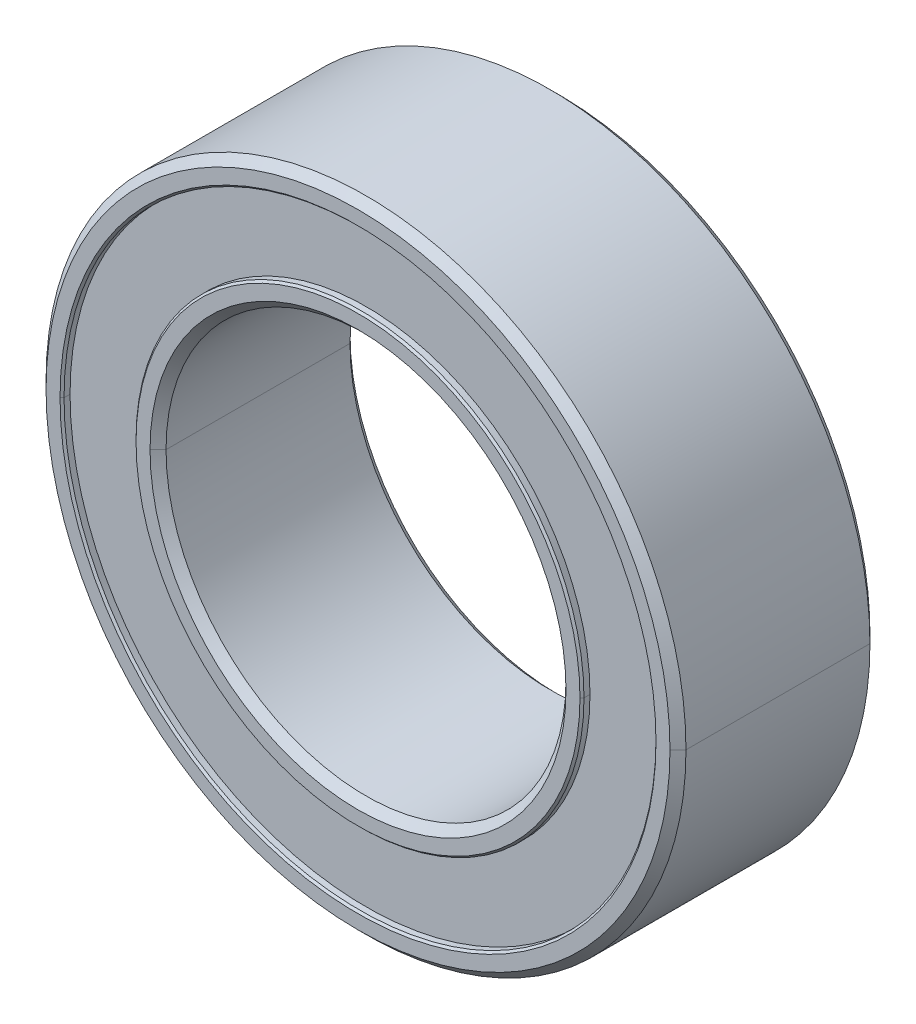
ISO-10303-21;
HEADER;
FILE_DESCRIPTION(('STEP AP214'),'2;1');
FILE_NAME('part.step','',(''),(''),'','','');
FILE_SCHEMA(('AUTOMOTIVE_DESIGN { 1 0 10303 214 1 1 1 1 }'));
ENDSEC;
DATA;
#1=APPLICATION_CONTEXT('core data for automotive mechanical design processes');
#2=APPLICATION_PROTOCOL_DEFINITION('international standard','automotive_design',2000,#1);
#3=PRODUCT_CONTEXT('',#1,'mechanical');
#4=PRODUCT('Part','Part','',(#3));
#5=PRODUCT_RELATED_PRODUCT_CATEGORY('part','',(#4));
#6=PRODUCT_DEFINITION_FORMATION('','',#4);
#7=PRODUCT_DEFINITION_CONTEXT('part definition',#1,'design');
#8=PRODUCT_DEFINITION('design','',#6,#7);
#9=PRODUCT_DEFINITION_SHAPE('','',#8);
#10=(LENGTH_UNIT() NAMED_UNIT(*) SI_UNIT(.MILLI.,.METRE.));
#11=(NAMED_UNIT(*) PLANE_ANGLE_UNIT() SI_UNIT($,.RADIAN.));
#12=(NAMED_UNIT(*) SI_UNIT($,.STERADIAN.) SOLID_ANGLE_UNIT());
#13=UNCERTAINTY_MEASURE_WITH_UNIT(LENGTH_MEASURE(1.E-05),#10,'distance_accuracy_value','');
#14=(GEOMETRIC_REPRESENTATION_CONTEXT(3) GLOBAL_UNCERTAINTY_ASSIGNED_CONTEXT((#13)) GLOBAL_UNIT_ASSIGNED_CONTEXT((#10,
#11,#12)) REPRESENTATION_CONTEXT('',''));
#15=CARTESIAN_POINT('',(0.,0.,0.));
#16=DIRECTION('',(0.,0.,1.));
#17=DIRECTION('',(1.,0.,0.));
#18=AXIS2_PLACEMENT_3D('',#15,#16,#17);
#19=CARTESIAN_POINT('',(0.,0.,1.25));
#20=DIRECTION('',(0.,0.,-1.));
#21=DIRECTION('',(-1.,0.,0.));
#22=AXIS2_PLACEMENT_3D('',#19,#20,#21);
#23=CYLINDRICAL_SURFACE('',#22,4.);
#24=CARTESIAN_POINT('',(0.,0.,1.15));
#25=DIRECTION('',(0.,0.,-1.));
#26=DIRECTION('',(1.,0.,0.));
#27=AXIS2_PLACEMENT_3D('',#24,#25,#26);
#28=CIRCLE('',#27,4.);
#29=CARTESIAN_POINT('',(-4.,0.,1.15));
#30=VERTEX_POINT('',#29);
#31=CARTESIAN_POINT('',(4.,0.,1.15));
#32=VERTEX_POINT('',#31);
#33=EDGE_CURVE('P0_E82',#30,#32,#28,.T.);
#34=ORIENTED_EDGE('',*,*,#33,.T.);
#35=DIRECTION('',(0.,0.,-1.));
#36=VECTOR('',#35,1.);
#37=CARTESIAN_POINT('',(4.,0.,1.25));
#38=LINE('',#37,#36);
#39=CARTESIAN_POINT('',(4.,0.,-1.15));
#40=VERTEX_POINT('',#39);
#41=EDGE_CURVE('P0_E28',#32,#40,#38,.T.);
#42=ORIENTED_EDGE('',*,*,#41,.T.);
#43=CARTESIAN_POINT('',(0.,0.,-1.15));
#44=DIRECTION('',(0.,0.,1.));
#45=DIRECTION('',(1.,0.,0.));
#46=AXIS2_PLACEMENT_3D('',#43,#44,#45);
#47=CIRCLE('',#46,4.);
#48=CARTESIAN_POINT('',(-4.,0.,-1.15));
#49=VERTEX_POINT('',#48);
#50=EDGE_CURVE('P0_E84',#40,#49,#47,.T.);
#51=ORIENTED_EDGE('',*,*,#50,.T.);
#52=DIRECTION('',(0.,0.,-1.));
#53=VECTOR('',#52,1.);
#54=CARTESIAN_POINT('',(-4.,0.,1.25));
#55=LINE('',#54,#53);
#56=EDGE_CURVE('P0_E11',#30,#49,#55,.T.);
#57=ORIENTED_EDGE('',*,*,#56,.F.);
#58=EDGE_LOOP('',(#34,#42,#51,#57));
#59=FACE_BOUND('',#58,.T.);
#60=ADVANCED_FACE('P0_F17',(#59),#23,.T.);
#61=CARTESIAN_POINT('',(0.,0.,1.25));
#62=DIRECTION('',(0.,0.,-1.));
#63=DIRECTION('',(-1.,0.,0.));
#64=AXIS2_PLACEMENT_3D('',#61,#62,#63);
#65=CYLINDRICAL_SURFACE('',#64,4.);
#66=ORIENTED_EDGE('',*,*,#41,.F.);
#67=CARTESIAN_POINT('',(0.,0.,1.15));
#68=DIRECTION('',(0.,0.,-1.));
#69=DIRECTION('',(1.,0.,0.));
#70=AXIS2_PLACEMENT_3D('',#67,#68,#69);
#71=CIRCLE('',#70,4.);
#72=EDGE_CURVE('P0_E100',#32,#30,#71,.T.);
#73=ORIENTED_EDGE('',*,*,#72,.T.);
#74=ORIENTED_EDGE('',*,*,#56,.T.);
#75=CARTESIAN_POINT('',(0.,0.,-1.15));
#76=DIRECTION('',(0.,0.,1.));
#77=DIRECTION('',(1.,0.,0.));
#78=AXIS2_PLACEMENT_3D('',#75,#76,#77);
#79=CIRCLE('',#78,4.);
#80=EDGE_CURVE('P0_E123',#49,#40,#79,.T.);
#81=ORIENTED_EDGE('',*,*,#80,.T.);
#82=EDGE_LOOP('',(#66,#73,#74,#81));
#83=FACE_BOUND('',#82,.T.);
#84=ADVANCED_FACE('P0_F102',(#83),#65,.T.);
#85=CARTESIAN_POINT('',(0.,0.,-1.15));
#86=DIRECTION('',(0.,0.,1.));
#87=DIRECTION('',(1.,0.,0.));
#88=AXIS2_PLACEMENT_3D('',#85,#86,#87);
#89=CONICAL_SURFACE('',#88,4.,0.785398163397);
#90=CARTESIAN_POINT('',(-3.90000000037,0.,-1.25));
#91=CARTESIAN_POINT('',(-3.90000000037,0.386984069698,-1.25));
#92=CARTESIAN_POINT('',(-3.85200106762,0.773967704262,-1.25));
#93=CARTESIAN_POINT('',(-3.7559891833,1.15303288636,-1.25));
#94=CARTESIAN_POINT('',(-3.47197707514,1.8793804213,-1.25));
#95=CARTESIAN_POINT('',(-3.01911954488,2.51433001158,-1.25));
#96=CARTESIAN_POINT('',(-2.75423633879,2.80198532663,-1.25));
#97=CARTESIAN_POINT('',(-2.15870257849,3.30555574085,-1.25));
#98=CARTESIAN_POINT('',(-1.45819006677,3.64837223469,-1.25));
#99=CARTESIAN_POINT('',(-1.0883110124,3.77525081534,-1.25));
#100=CARTESIAN_POINT('',(-0.324866052826,3.93461022536,-1.25));
#101=CARTESIAN_POINT('',(0.454375803529,3.90262486812,-1.25));
#102=CARTESIAN_POINT('',(0.840055924927,3.838130485,-1.25));
#103=CARTESIAN_POINT('',(1.58731054955,3.61485003796,-1.25));
#104=CARTESIAN_POINT('',(2.25737085966,3.21577596133,-1.25));
#105=CARTESIAN_POINT('',(2.56584692078,2.97546116697,-1.25));
#106=CARTESIAN_POINT('',(3.11671390529,2.42338399977,-1.25));
#107=CARTESIAN_POINT('',(3.51601044717,1.75345623454,-1.25));
#108=CARTESIAN_POINT('',(3.67289474559,1.39527193193,-1.25));
#109=CARTESIAN_POINT('',(3.8204957911,0.897313198204,-1.25));
#110=CARTESIAN_POINT('',(3.88410191712,0.385389729641,-1.25));
#111=CARTESIAN_POINT('',(3.89471260262,0.256878859636,-1.25));
#112=CARTESIAN_POINT('',(3.90000000037,0.128439405852,-1.25));
#113=CARTESIAN_POINT('',(3.90000000037,0.,-1.25));
#114=(BOUNDED_CURVE() B_SPLINE_CURVE(5,(#90,#91,#92,#93,#94,#95,#96,#97,#98,#99,#100,#101,#102,
#103,#104,#105,#106,#107,#108,#109,#110,#111,#112,#113),.UNSPECIFIED.,.F.,
.F.) B_SPLINE_CURVE_WITH_KNOTS((6,3,3,3,3,3,3,6),(0.,2.73639059894,5.47278120241,8.209171813,
10.9455624439,13.6819530727,16.4183437087,17.3265474572),
.UNSPECIFIED.) CURVE() GEOMETRIC_REPRESENTATION_ITEM() RATIONAL_B_SPLINE_CURVE((1.,1.,1.,1.,1.,
1.,1.,1.,1.,1.,1.,1.,1.,1.,1.,1.,1.,1.,1.,1.,1.,1.,1.,1.)) REPRESENTATION_ITEM(''));
#115=CARTESIAN_POINT('',(-3.9,0.,-1.25));
#116=VERTEX_POINT('',#115);
#117=CARTESIAN_POINT('',(3.9,0.,-1.25));
#118=VERTEX_POINT('',#117);
#119=EDGE_CURVE('P0_E115',#116,#118,#114,.T.);
#120=ORIENTED_EDGE('',*,*,#119,.F.);
#121=DIRECTION('',(-0.707106781186548,0.,0.707106781186548));
#122=VECTOR('',#121,1.);
#123=CARTESIAN_POINT('',(-3535535.90593,4.32978273047E-10,3535530.75593));
#124=LINE('',#123,#122);
#125=EDGE_CURVE('P0_E99',#116,#49,#124,.T.);
#126=ORIENTED_EDGE('',*,*,#125,.T.);
#127=ORIENTED_EDGE('',*,*,#50,.F.);
#128=DIRECTION('',(0.707106781186548,0.,0.707106781186548));
#129=VECTOR('',#128,1.);
#130=CARTESIAN_POINT('',(3535535.90593,-8.65956546094E-10,3535530.75593));
#131=LINE('',#130,#129);
#132=EDGE_CURVE('P0_E126',#118,#40,#131,.T.);
#133=ORIENTED_EDGE('',*,*,#132,.F.);
#134=EDGE_LOOP('',(#120,#126,#127,#133));
#135=FACE_BOUND('',#134,.T.);
#136=ADVANCED_FACE('P0_F19',(#135),#89,.T.);
#137=CARTESIAN_POINT('',(0.,0.,-1.15));
#138=DIRECTION('',(0.,0.,1.));
#139=DIRECTION('',(1.,0.,0.));
#140=AXIS2_PLACEMENT_3D('',#137,#138,#139);
#141=CONICAL_SURFACE('',#140,4.,0.785398163397);
#142=ORIENTED_EDGE('',*,*,#125,.F.);
#143=CARTESIAN_POINT('',(3.90000000037,0.,-1.25));
#144=CARTESIAN_POINT('',(3.90000000037,-0.386984069697,-1.25));
#145=CARTESIAN_POINT('',(3.85200106762,-0.773967704261,-1.25));
#146=CARTESIAN_POINT('',(3.7559891833,-1.15303288636,-1.25));
#147=CARTESIAN_POINT('',(3.47197707514,-1.8793804213,-1.25));
#148=CARTESIAN_POINT('',(3.01911954488,-2.51433001158,-1.25));
#149=CARTESIAN_POINT('',(2.75423633879,-2.80198532663,-1.25));
#150=CARTESIAN_POINT('',(2.15870257849,-3.30555574085,-1.25));
#151=CARTESIAN_POINT('',(1.45819006677,-3.64837223469,-1.25));
#152=CARTESIAN_POINT('',(1.08831101241,-3.77525081534,-1.25));
#153=CARTESIAN_POINT('',(0.324866052826,-3.93461022536,-1.25));
#154=CARTESIAN_POINT('',(-0.454375803531,-3.90262486812,-1.25));
#155=CARTESIAN_POINT('',(-0.840055924924,-3.838130485,-1.25));
#156=CARTESIAN_POINT('',(-1.58731054955,-3.61485003796,-1.25));
#157=CARTESIAN_POINT('',(-2.25737085965,-3.21577596133,-1.25));
#158=CARTESIAN_POINT('',(-2.56584692078,-2.97546116697,-1.25));
#159=CARTESIAN_POINT('',(-3.11671390529,-2.42338399977,-1.25));
#160=CARTESIAN_POINT('',(-3.51601044717,-1.75345623454,-1.25));
#161=CARTESIAN_POINT('',(-3.67289474559,-1.39527193193,-1.25));
#162=CARTESIAN_POINT('',(-3.8204957911,-0.897313198203,-1.25));
#163=CARTESIAN_POINT('',(-3.88410191712,-0.385389729641,-1.25));
#164=CARTESIAN_POINT('',(-3.89471260262,-0.256878859636,-1.25));
#165=CARTESIAN_POINT('',(-3.90000000037,-0.128439405852,-1.25));
#166=CARTESIAN_POINT('',(-3.90000000037,0.,-1.25));
#167=(BOUNDED_CURVE() B_SPLINE_CURVE(5,(#143,#144,#145,#146,#147,#148,#149,#150,#151,#152,#153,
#154,#155,#156,#157,#158,#159,#160,#161,#162,#163,#164,#165,#166),.UNSPECIFIED.,.F.,
.F.) B_SPLINE_CURVE_WITH_KNOTS((6,3,3,3,3,3,3,6),(0.,2.73639059894,5.47278120241,8.20917181301,
10.9455624439,13.6819530727,16.4183437087,17.3265474572),
.UNSPECIFIED.) CURVE() GEOMETRIC_REPRESENTATION_ITEM() RATIONAL_B_SPLINE_CURVE((1.,1.,1.,1.,1.,
1.,1.,1.,1.,1.,1.,1.,1.,1.,1.,1.,1.,1.,1.,1.,1.,1.,1.,1.)) REPRESENTATION_ITEM(''));
#168=EDGE_CURVE('P0_E134',#118,#116,#167,.T.);
#169=ORIENTED_EDGE('',*,*,#168,.F.);
#170=ORIENTED_EDGE('',*,*,#132,.T.);
#171=ORIENTED_EDGE('',*,*,#80,.F.);
#172=EDGE_LOOP('',(#142,#169,#170,#171));
#173=FACE_BOUND('',#172,.T.);
#174=ADVANCED_FACE('P0_F190',(#173),#141,.T.);
#175=CARTESIAN_POINT('',(0.,0.,1.25));
#176=DIRECTION('',(0.,0.,-1.));
#177=DIRECTION('',(-1.,0.,0.));
#178=AXIS2_PLACEMENT_3D('',#175,#176,#177);
#179=CONICAL_SURFACE('',#178,3.9,0.785398163397);
#180=CARTESIAN_POINT('',(0.,0.,1.25));
#181=DIRECTION('',(0.,0.,1.));
#182=DIRECTION('',(1.,0.,0.));
#183=AXIS2_PLACEMENT_3D('',#180,#181,#182);
#184=CIRCLE('',#183,3.90000000037);
#185=CARTESIAN_POINT('',(3.9,0.,1.25));
#186=VERTEX_POINT('',#185);
#187=CARTESIAN_POINT('',(-3.9,0.,1.25));
#188=VERTEX_POINT('',#187);
#189=EDGE_CURVE('P0_E140',#186,#188,#184,.T.);
#190=ORIENTED_EDGE('',*,*,#189,.F.);
#191=DIRECTION('',(0.707106781186548,0.,-0.707106781186548));
#192=VECTOR('',#191,1.);
#193=CARTESIAN_POINT('',(3535535.85593,4.32978266924E-10,-3535530.70593));
#194=LINE('',#193,#192);
#195=EDGE_CURVE('P0_E97',#186,#32,#194,.T.);
#196=ORIENTED_EDGE('',*,*,#195,.T.);
#197=ORIENTED_EDGE('',*,*,#33,.F.);
#198=DIRECTION('',(-0.707106781186548,0.,-0.707106781186548));
#199=VECTOR('',#198,1.);
#200=CARTESIAN_POINT('',(-3535535.85593,-8.65956533848E-10,-3535530.70593));
#201=LINE('',#200,#199);
#202=EDGE_CURVE('P0_E94',#188,#30,#201,.T.);
#203=ORIENTED_EDGE('',*,*,#202,.F.);
#204=EDGE_LOOP('',(#190,#196,#197,#203));
#205=FACE_BOUND('',#204,.T.);
#206=ADVANCED_FACE('P0_F92',(#205),#179,.T.);
#207=CARTESIAN_POINT('',(0.,0.,1.25));
#208=DIRECTION('',(0.,0.,-1.));
#209=DIRECTION('',(-1.,0.,0.));
#210=AXIS2_PLACEMENT_3D('',#207,#208,#209);
#211=CONICAL_SURFACE('',#210,3.9,0.785398163397);
#212=ORIENTED_EDGE('',*,*,#195,.F.);
#213=CARTESIAN_POINT('',(0.,0.,1.25));
#214=DIRECTION('',(0.,0.,1.));
#215=DIRECTION('',(1.,0.,0.));
#216=AXIS2_PLACEMENT_3D('',#213,#214,#215);
#217=CIRCLE('',#216,3.90000000037);
#218=EDGE_CURVE('P0_E109',#188,#186,#217,.T.);
#219=ORIENTED_EDGE('',*,*,#218,.F.);
#220=ORIENTED_EDGE('',*,*,#202,.T.);
#221=ORIENTED_EDGE('',*,*,#72,.F.);
#222=EDGE_LOOP('',(#212,#219,#220,#221));
#223=FACE_BOUND('',#222,.T.);
#224=ADVANCED_FACE('P0_F107',(#223),#211,.T.);
#225=CARTESIAN_POINT('',(0.,0.,-1.25));
#226=DIRECTION('',(0.,0.,1.));
#227=DIRECTION('',(1.,0.,0.));
#228=AXIS2_PLACEMENT_3D('',#225,#226,#227);
#229=PLANE('',#228);
#230=CARTESIAN_POINT('',(0.,0.,-1.25));
#231=DIRECTION('',(0.,0.,1.));
#232=DIRECTION('',(1.,0.,0.));
#233=AXIS2_PLACEMENT_3D('',#230,#231,#232);
#234=CIRCLE('',#233,3.7);
#235=CARTESIAN_POINT('',(-3.7,0.,-1.25));
#236=VERTEX_POINT('',#235);
#237=CARTESIAN_POINT('',(3.7,0.,-1.25));
#238=VERTEX_POINT('',#237);
#239=EDGE_CURVE('P0_E174',#236,#238,#234,.T.);
#240=ORIENTED_EDGE('',*,*,#239,.T.);
#241=CARTESIAN_POINT('',(0.,0.,-1.25));
#242=DIRECTION('',(0.,0.,1.));
#243=DIRECTION('',(1.,0.,0.));
#244=AXIS2_PLACEMENT_3D('',#241,#242,#243);
#245=CIRCLE('',#244,3.7);
#246=EDGE_CURVE('P0_E142',#238,#236,#245,.T.);
#247=ORIENTED_EDGE('',*,*,#246,.T.);
#248=EDGE_LOOP('',(#240,#247));
#249=FACE_BOUND('',#248,.T.);
#250=ORIENTED_EDGE('',*,*,#168,.T.);
#251=ORIENTED_EDGE('',*,*,#119,.T.);
#252=EDGE_LOOP('',(#250,#251));
#253=FACE_BOUND('',#252,.T.);
#254=ADVANCED_FACE('P0_F194',(#249,#253),#229,.F.);
#255=CARTESIAN_POINT('',(0.,0.,1.25));
#256=DIRECTION('',(0.,0.,-1.));
#257=DIRECTION('',(-1.,0.,0.));
#258=AXIS2_PLACEMENT_3D('',#255,#256,#257);
#259=CYLINDRICAL_SURFACE('',#258,3.7);
#260=DIRECTION('',(0.,0.,-1.));
#261=VECTOR('',#260,1.);
#262=CARTESIAN_POINT('',(3.7,0.,1.25));
#263=LINE('',#262,#261);
#264=CARTESIAN_POINT('',(3.7,0.,1.225));
#265=VERTEX_POINT('',#264);
#266=EDGE_CURVE('P0_E177',#265,#238,#263,.T.);
#267=ORIENTED_EDGE('',*,*,#266,.F.);
#268=CARTESIAN_POINT('',(0.,0.,1.225));
#269=DIRECTION('',(0.,0.,1.));
#270=DIRECTION('',(1.,0.,0.));
#271=AXIS2_PLACEMENT_3D('',#268,#269,#270);
#272=CIRCLE('',#271,3.7);
#273=CARTESIAN_POINT('',(-3.7,0.,1.225));
#274=VERTEX_POINT('',#273);
#275=EDGE_CURVE('P0_E153',#265,#274,#272,.T.);
#276=ORIENTED_EDGE('',*,*,#275,.T.);
#277=DIRECTION('',(0.,0.,-1.));
#278=VECTOR('',#277,1.);
#279=CARTESIAN_POINT('',(-3.7,0.,1.25));
#280=LINE('',#279,#278);
#281=EDGE_CURVE('P0_E157',#274,#236,#280,.T.);
#282=ORIENTED_EDGE('',*,*,#281,.T.);
#283=ORIENTED_EDGE('',*,*,#246,.F.);
#284=EDGE_LOOP('',(#267,#276,#282,#283));
#285=FACE_BOUND('',#284,.T.);
#286=ADVANCED_FACE('P0_F204',(#285),#259,.F.);
#287=CARTESIAN_POINT('',(0.,0.,1.25));
#288=DIRECTION('',(0.,0.,1.));
#289=DIRECTION('',(1.,0.,0.));
#290=AXIS2_PLACEMENT_3D('',#287,#288,#289);
#291=PLANE('',#290);
#292=CARTESIAN_POINT('',(0.,0.,1.25));
#293=DIRECTION('',(0.,0.,-1.));
#294=DIRECTION('',(1.,0.,0.));
#295=AXIS2_PLACEMENT_3D('',#292,#293,#294);
#296=CIRCLE('',#295,3.725);
#297=CARTESIAN_POINT('',(3.725,0.,1.25));
#298=VERTEX_POINT('',#297);
#299=CARTESIAN_POINT('',(-3.725,0.,1.25));
#300=VERTEX_POINT('',#299);
#301=EDGE_CURVE('P0_E121',#298,#300,#296,.T.);
#302=ORIENTED_EDGE('',*,*,#301,.T.);
#303=CARTESIAN_POINT('',(0.,0.,1.25));
#304=DIRECTION('',(0.,0.,-1.));
#305=DIRECTION('',(1.,0.,0.));
#306=AXIS2_PLACEMENT_3D('',#303,#304,#305);
#307=CIRCLE('',#306,3.725);
#308=EDGE_CURVE('P0_E141',#300,#298,#307,.T.);
#309=ORIENTED_EDGE('',*,*,#308,.T.);
#310=EDGE_LOOP('',(#302,#309));
#311=FACE_BOUND('',#310,.T.);
#312=ORIENTED_EDGE('',*,*,#218,.T.);
#313=ORIENTED_EDGE('',*,*,#189,.T.);
#314=EDGE_LOOP('',(#312,#313));
#315=FACE_BOUND('',#314,.T.);
#316=ADVANCED_FACE('P0_F227',(#311,#315),#291,.T.);
#317=CARTESIAN_POINT('',(0.,0.,1.225));
#318=DIRECTION('',(0.,0.,1.));
#319=DIRECTION('',(1.,0.,0.));
#320=AXIS2_PLACEMENT_3D('',#317,#318,#319);
#321=CONICAL_SURFACE('',#320,3.7,0.785398163397);
#322=DIRECTION('',(-0.707106781186548,0.,0.707106781186548));
#323=VECTOR('',#322,1.);
#324=CARTESIAN_POINT('',(-3535535.75593,4.32978254677E-10,3535533.28093));
#325=LINE('',#324,#323);
#326=EDGE_CURVE('P0_E118',#274,#300,#325,.T.);
#327=ORIENTED_EDGE('',*,*,#326,.F.);
#328=ORIENTED_EDGE('',*,*,#275,.F.);
#329=DIRECTION('',(0.707106781186548,0.,0.707106781186548));
#330=VECTOR('',#329,1.);
#331=CARTESIAN_POINT('',(3535535.75593,-8.65956509355E-10,3535533.28093));
#332=LINE('',#331,#330);
#333=EDGE_CURVE('P0_E21',#265,#298,#332,.T.);
#334=ORIENTED_EDGE('',*,*,#333,.T.);
#335=ORIENTED_EDGE('',*,*,#308,.F.);
#336=EDGE_LOOP('',(#327,#328,#334,#335));
#337=FACE_BOUND('',#336,.T.);
#338=ADVANCED_FACE('P0_F214',(#337),#321,.F.);
#339=CARTESIAN_POINT('',(0.,0.,1.25));
#340=DIRECTION('',(0.,0.,-1.));
#341=DIRECTION('',(-1.,0.,0.));
#342=AXIS2_PLACEMENT_3D('',#339,#340,#341);
#343=CYLINDRICAL_SURFACE('',#342,3.7);
#344=CARTESIAN_POINT('',(0.,0.,1.225));
#345=DIRECTION('',(0.,0.,1.));
#346=DIRECTION('',(1.,0.,0.));
#347=AXIS2_PLACEMENT_3D('',#344,#345,#346);
#348=CIRCLE('',#347,3.7);
#349=EDGE_CURVE('P0_E122',#274,#265,#348,.T.);
#350=ORIENTED_EDGE('',*,*,#349,.T.);
#351=ORIENTED_EDGE('',*,*,#266,.T.);
#352=ORIENTED_EDGE('',*,*,#239,.F.);
#353=ORIENTED_EDGE('',*,*,#281,.F.);
#354=EDGE_LOOP('',(#350,#351,#352,#353));
#355=FACE_BOUND('',#354,.T.);
#356=ADVANCED_FACE('P0_F211',(#355),#343,.F.);
#357=CARTESIAN_POINT('',(0.,0.,1.225));
#358=DIRECTION('',(0.,0.,1.));
#359=DIRECTION('',(1.,0.,0.));
#360=AXIS2_PLACEMENT_3D('',#357,#358,#359);
#361=CONICAL_SURFACE('',#360,3.7,0.785398163397);
#362=ORIENTED_EDGE('',*,*,#349,.F.);
#363=ORIENTED_EDGE('',*,*,#326,.T.);
#364=ORIENTED_EDGE('',*,*,#301,.F.);
#365=ORIENTED_EDGE('',*,*,#333,.F.);
#366=EDGE_LOOP('',(#362,#363,#364,#365));
#367=FACE_BOUND('',#366,.T.);
#368=ADVANCED_FACE('P0_F217',(#367),#361,.F.);
#369=CLOSED_SHELL('',(#60,#84,#136,#174,#206,#224,#254,#286,#316,#338,#356,#368));
#370=MANIFOLD_SOLID_BREP('P0_B1',#369);
#371=CARTESIAN_POINT('',(0.,0.,-1.225));
#372=DIRECTION('',(0.,0.,1.));
#373=DIRECTION('',(1.,0.,0.));
#374=AXIS2_PLACEMENT_3D('',#371,#372,#373);
#375=CONICAL_SURFACE('',#374,2.8,0.785398163397);
#376=CARTESIAN_POINT('',(-2.77500000037,0.,-1.25));
#377=CARTESIAN_POINT('',(-2.77500000037,0.326428406667,-1.25));
#378=CARTESIAN_POINT('',(-2.7270020253,0.652856201807,-1.25));
#379=CARTESIAN_POINT('',(-2.63097901262,0.969903242157,-1.25));
#380=CARTESIAN_POINT('',(-2.3486111357,1.56631519937,-1.25));
#381=CARTESIAN_POINT('',(-1.90651570836,2.0562001654,-1.25));
#382=CARTESIAN_POINT('',(-1.65071808528,2.26669200926,-1.25));
#383=CARTESIAN_POINT('',(-1.08488655826,2.60621156579,-1.25));
#384=CARTESIAN_POINT('',(-0.445274188632,2.76848192372,-1.25));
#385=CARTESIAN_POINT('',(-0.115672224209,2.8016749986,-1.25));
#386=CARTESIAN_POINT('',(0.543454313596,2.77019403233,-1.25));
#387=CARTESIAN_POINT('',(1.16561820026,2.55031281878,-1.25));
#388=CARTESIAN_POINT('',(1.45824958018,2.3950513626,-1.25));
#389=CARTESIAN_POINT('',(1.98914724597,2.00315022065,-1.25));
#390=CARTESIAN_POINT('',(2.38476143708,1.4750166633,-1.25));
#391=CARTESIAN_POINT('',(2.5420726101,1.18348202708,-1.25));
#392=CARTESIAN_POINT('',(2.69242685318,0.767362234326,-1.25));
#393=CARTESIAN_POINT('',(2.75819942412,0.334033351842,-1.25));
#394=CARTESIAN_POINT('',(2.76941855339,0.222628122368,-1.25));
#395=CARTESIAN_POINT('',(2.77500000037,0.111314025628,-1.25));
#396=CARTESIAN_POINT('',(2.77500000037,0.,-1.25));
#397=(BOUNDED_CURVE() B_SPLINE_CURVE(5,(#376,#377,#378,#379,#380,#381,#382,#383,#384,#385,#386,
#387,#388,#389,#390,#391,#392,#393,#394,#395,#396),.UNSPECIFIED.,.F.,
.F.) B_SPLINE_CURVE_WITH_KNOTS((6,3,3,3,3,3,6),(0.,2.30819739926,4.61639481179,6.92459224022,
9.23278964065,11.5409870307,12.3280960543),
.UNSPECIFIED.) CURVE() GEOMETRIC_REPRESENTATION_ITEM() RATIONAL_B_SPLINE_CURVE((1.,1.,1.,1.,1.,
1.,1.,1.,1.,1.,1.,1.,1.,1.,1.,1.,1.,1.,1.,1.,1.)) REPRESENTATION_ITEM(''));
#398=CARTESIAN_POINT('',(-2.775,0.,-1.25));
#399=VERTEX_POINT('',#398);
#400=CARTESIAN_POINT('',(2.775,0.,-1.25));
#401=VERTEX_POINT('',#400);
#402=EDGE_CURVE('P1_E90',#399,#401,#397,.T.);
#403=ORIENTED_EDGE('',*,*,#402,.F.);
#404=DIRECTION('',(-0.707106781186548,0.,0.707106781186548));
#405=VECTOR('',#404,1.);
#406=CARTESIAN_POINT('',(-3535535.30593,4.32978199568E-10,3535531.28093));
#407=LINE('',#406,#405);
#408=CARTESIAN_POINT('',(-2.8,0.,-1.225));
#409=VERTEX_POINT('',#408);
#410=EDGE_CURVE('P1_E28',#399,#409,#407,.T.);
#411=ORIENTED_EDGE('',*,*,#410,.T.);
#412=CARTESIAN_POINT('',(0.,0.,-1.22499999963));
#413=DIRECTION('',(0.,0.,1.));
#414=DIRECTION('',(1.,0.,0.));
#415=AXIS2_PLACEMENT_3D('',#412,#413,#414);
#416=CIRCLE('',#415,2.8);
#417=CARTESIAN_POINT('',(2.8,0.,-1.225));
#418=VERTEX_POINT('',#417);
#419=EDGE_CURVE('P1_E92',#418,#409,#416,.T.);
#420=ORIENTED_EDGE('',*,*,#419,.F.);
#421=DIRECTION('',(0.707106781186548,0.,0.707106781186548));
#422=VECTOR('',#421,1.);
#423=CARTESIAN_POINT('',(3535535.30593,-8.65956399137E-10,3535531.28093));
#424=LINE('',#423,#422);
#425=EDGE_CURVE('P1_E11',#401,#418,#424,.T.);
#426=ORIENTED_EDGE('',*,*,#425,.F.);
#427=EDGE_LOOP('',(#403,#411,#420,#426));
#428=FACE_BOUND('',#427,.T.);
#429=ADVANCED_FACE('P1_F17',(#428),#375,.T.);
#430=CARTESIAN_POINT('',(0.,0.,-1.225));
#431=DIRECTION('',(0.,0.,1.));
#432=DIRECTION('',(1.,0.,0.));
#433=AXIS2_PLACEMENT_3D('',#430,#431,#432);
#434=CONICAL_SURFACE('',#433,2.8,0.785398163397);
#435=ORIENTED_EDGE('',*,*,#410,.F.);
#436=CARTESIAN_POINT('',(2.77500000037,0.,-1.25));
#437=CARTESIAN_POINT('',(2.77500000037,-0.326428406665,-1.25));
#438=CARTESIAN_POINT('',(2.7270020253,-0.652856201803,-1.25));
#439=CARTESIAN_POINT('',(2.63097901262,-0.969903242161,-1.25));
#440=CARTESIAN_POINT('',(2.3486111357,-1.56631519937,-1.25));
#441=CARTESIAN_POINT('',(1.90651570837,-2.0562001654,-1.25));
#442=CARTESIAN_POINT('',(1.65071808528,-2.26669200926,-1.25));
#443=CARTESIAN_POINT('',(1.08488655826,-2.60621156579,-1.25));
#444=CARTESIAN_POINT('',(0.445274188631,-2.76848192372,-1.25));
#445=CARTESIAN_POINT('',(0.11567222421,-2.8016749986,-1.25));
#446=CARTESIAN_POINT('',(-0.543454313596,-2.77019403233,-1.25));
#447=CARTESIAN_POINT('',(-1.16561820026,-2.55031281878,-1.25));
#448=CARTESIAN_POINT('',(-1.45824958018,-2.3950513626,-1.25));
#449=CARTESIAN_POINT('',(-1.98914724597,-2.00315022065,-1.25));
#450=CARTESIAN_POINT('',(-2.38476143708,-1.4750166633,-1.25));
#451=CARTESIAN_POINT('',(-2.5420726101,-1.18348202709,-1.25));
#452=CARTESIAN_POINT('',(-2.69242685318,-0.767362234326,-1.25));
#453=CARTESIAN_POINT('',(-2.75819942412,-0.334033351842,-1.25));
#454=CARTESIAN_POINT('',(-2.76941855339,-0.222628122368,-1.25));
#455=CARTESIAN_POINT('',(-2.77500000037,-0.111314025628,-1.25));
#456=CARTESIAN_POINT('',(-2.77500000037,0.,-1.25));
#457=(BOUNDED_CURVE() B_SPLINE_CURVE(5,(#436,#437,#438,#439,#440,#441,#442,#443,#444,#445,#446,
#447,#448,#449,#450,#451,#452,#453,#454,#455,#456),.UNSPECIFIED.,.F.,
.F.) B_SPLINE_CURVE_WITH_KNOTS((6,3,3,3,3,3,6),(0.,2.30819739924,4.61639481177,6.92459224021,
9.23278964064,11.5409870306,12.3280960543),
.UNSPECIFIED.) CURVE() GEOMETRIC_REPRESENTATION_ITEM() RATIONAL_B_SPLINE_CURVE((1.,1.,1.,1.,1.,
1.,1.,1.,1.,1.,1.,1.,1.,1.,1.,1.,1.,1.,1.,1.,1.)) REPRESENTATION_ITEM(''));
#458=EDGE_CURVE('P1_E96',#401,#399,#457,.T.);
#459=ORIENTED_EDGE('',*,*,#458,.F.);
#460=ORIENTED_EDGE('',*,*,#425,.T.);
#461=CARTESIAN_POINT('',(0.,0.,-1.22499999963));
#462=DIRECTION('',(0.,0.,1.));
#463=DIRECTION('',(1.,0.,0.));
#464=AXIS2_PLACEMENT_3D('',#461,#462,#463);
#465=CIRCLE('',#464,2.8);
#466=EDGE_CURVE('P1_E115',#409,#418,#465,.T.);
#467=ORIENTED_EDGE('',*,*,#466,.F.);
#468=EDGE_LOOP('',(#435,#459,#460,#467));
#469=FACE_BOUND('',#468,.T.);
#470=ADVANCED_FACE('P1_F100',(#469),#434,.T.);
#471=CARTESIAN_POINT('',(0.,0.,1.25));
#472=DIRECTION('',(0.,0.,-1.));
#473=DIRECTION('',(-1.,0.,0.));
#474=AXIS2_PLACEMENT_3D('',#471,#472,#473);
#475=CYLINDRICAL_SURFACE('',#474,2.8);
#476=CARTESIAN_POINT('',(0.,0.,1.225));
#477=DIRECTION('',(0.,0.,-1.));
#478=DIRECTION('',(1.,0.,0.));
#479=AXIS2_PLACEMENT_3D('',#476,#477,#478);
#480=CIRCLE('',#479,2.8);
#481=CARTESIAN_POINT('',(-2.8,0.,1.225));
#482=VERTEX_POINT('',#481);
#483=CARTESIAN_POINT('',(2.8,0.,1.225));
#484=VERTEX_POINT('',#483);
#485=EDGE_CURVE('P1_E109',#482,#484,#480,.T.);
#486=ORIENTED_EDGE('',*,*,#485,.T.);
#487=DIRECTION('',(0.,0.,-1.));
#488=VECTOR('',#487,1.);
#489=CARTESIAN_POINT('',(2.8,0.,1.25));
#490=LINE('',#489,#488);
#491=EDGE_CURVE('P1_E98',#484,#418,#490,.T.);
#492=ORIENTED_EDGE('',*,*,#491,.T.);
#493=ORIENTED_EDGE('',*,*,#419,.T.);
#494=DIRECTION('',(0.,0.,-1.));
#495=VECTOR('',#494,1.);
#496=CARTESIAN_POINT('',(-2.8,0.,1.25));
#497=LINE('',#496,#495);
#498=EDGE_CURVE('P1_E158',#482,#409,#497,.T.);
#499=ORIENTED_EDGE('',*,*,#498,.F.);
#500=EDGE_LOOP('',(#486,#492,#493,#499));
#501=FACE_BOUND('',#500,.T.);
#502=ADVANCED_FACE('P1_F222',(#501),#475,.T.);
#503=CARTESIAN_POINT('',(0.,0.,1.25));
#504=DIRECTION('',(0.,0.,-1.));
#505=DIRECTION('',(-1.,0.,0.));
#506=AXIS2_PLACEMENT_3D('',#503,#504,#505);
#507=CYLINDRICAL_SURFACE('',#506,2.8);
#508=ORIENTED_EDGE('',*,*,#491,.F.);
#509=CARTESIAN_POINT('',(0.,0.,1.225));
#510=DIRECTION('',(0.,0.,-1.));
#511=DIRECTION('',(1.,0.,0.));
#512=AXIS2_PLACEMENT_3D('',#509,#510,#511);
#513=CIRCLE('',#512,2.8);
#514=EDGE_CURVE('P1_E145',#484,#482,#513,.T.);
#515=ORIENTED_EDGE('',*,*,#514,.T.);
#516=ORIENTED_EDGE('',*,*,#498,.T.);
#517=ORIENTED_EDGE('',*,*,#466,.T.);
#518=EDGE_LOOP('',(#508,#515,#516,#517));
#519=FACE_BOUND('',#518,.T.);
#520=ADVANCED_FACE('P1_F214',(#519),#507,.T.);
#521=CARTESIAN_POINT('',(0.,0.,-1.25));
#522=DIRECTION('',(0.,0.,1.));
#523=DIRECTION('',(1.,0.,0.));
#524=AXIS2_PLACEMENT_3D('',#521,#522,#523);
#525=PLANE('',#524);
#526=CARTESIAN_POINT('',(0.,0.,-1.25));
#527=DIRECTION('',(0.,0.,1.));
#528=DIRECTION('',(1.,0.,0.));
#529=AXIS2_PLACEMENT_3D('',#526,#527,#528);
#530=CIRCLE('',#529,2.6);
#531=CARTESIAN_POINT('',(-2.6,0.,-1.25));
#532=VERTEX_POINT('',#531);
#533=CARTESIAN_POINT('',(2.6,0.,-1.25));
#534=VERTEX_POINT('',#533);
#535=EDGE_CURVE('P1_E131',#532,#534,#530,.T.);
#536=ORIENTED_EDGE('',*,*,#535,.T.);
#537=CARTESIAN_POINT('',(0.,0.,-1.25));
#538=DIRECTION('',(0.,0.,1.));
#539=DIRECTION('',(1.,0.,0.));
#540=AXIS2_PLACEMENT_3D('',#537,#538,#539);
#541=CIRCLE('',#540,2.6);
#542=EDGE_CURVE('P1_E102',#534,#532,#541,.T.);
#543=ORIENTED_EDGE('',*,*,#542,.T.);
#544=EDGE_LOOP('',(#536,#543));
#545=FACE_BOUND('',#544,.T.);
#546=ORIENTED_EDGE('',*,*,#458,.T.);
#547=ORIENTED_EDGE('',*,*,#402,.T.);
#548=EDGE_LOOP('',(#546,#547));
#549=FACE_BOUND('',#548,.T.);
#550=ADVANCED_FACE('P1_F95',(#545,#549),#525,.F.);
#551=CARTESIAN_POINT('',(0.,0.,-1.25));
#552=DIRECTION('',(0.,0.,-1.));
#553=DIRECTION('',(-1.,0.,0.));
#554=AXIS2_PLACEMENT_3D('',#551,#552,#553);
#555=CONICAL_SURFACE('',#554,2.6,0.785398163397);
#556=DIRECTION('',(0.707106781186548,0.,-0.707106781186548));
#557=VECTOR('',#556,1.);
#558=CARTESIAN_POINT('',(3535535.20593,4.32978187322E-10,-3535533.85593));
#559=LINE('',#558,#557);
#560=CARTESIAN_POINT('',(2.5,0.,-1.15));
#561=VERTEX_POINT('',#560);
#562=EDGE_CURVE('P1_E136',#561,#534,#559,.T.);
#563=ORIENTED_EDGE('',*,*,#562,.F.);
#564=CARTESIAN_POINT('',(0.,0.,-1.15000000037));
#565=DIRECTION('',(0.,0.,-1.));
#566=DIRECTION('',(1.,0.,0.));
#567=AXIS2_PLACEMENT_3D('',#564,#565,#566);
#568=CIRCLE('',#567,2.5);
#569=CARTESIAN_POINT('',(-2.5,0.,-1.15));
#570=VERTEX_POINT('',#569);
#571=EDGE_CURVE('P1_E125',#570,#561,#568,.T.);
#572=ORIENTED_EDGE('',*,*,#571,.F.);
#573=DIRECTION('',(-0.707106781186548,0.,-0.707106781186548));
#574=VECTOR('',#573,1.);
#575=CARTESIAN_POINT('',(-3535535.20593,-8.65956374644E-10,-3535533.85593));
#576=LINE('',#575,#574);
#577=EDGE_CURVE('P1_E135',#570,#532,#576,.T.);
#578=ORIENTED_EDGE('',*,*,#577,.T.);
#579=ORIENTED_EDGE('',*,*,#542,.F.);
#580=EDGE_LOOP('',(#563,#572,#578,#579));
#581=FACE_BOUND('',#580,.T.);
#582=ADVANCED_FACE('P1_F213',(#581),#555,.F.);
#583=CARTESIAN_POINT('',(0.,0.,1.25));
#584=DIRECTION('',(0.,0.,-1.));
#585=DIRECTION('',(-1.,0.,0.));
#586=AXIS2_PLACEMENT_3D('',#583,#584,#585);
#587=CONICAL_SURFACE('',#586,2.775,0.785398163397);
#588=CARTESIAN_POINT('',(0.,0.,1.25));
#589=DIRECTION('',(0.,0.,1.));
#590=DIRECTION('',(1.,0.,0.));
#591=AXIS2_PLACEMENT_3D('',#588,#589,#590);
#592=CIRCLE('',#591,2.77500000037);
#593=CARTESIAN_POINT('',(2.775,0.,1.25));
#594=VERTEX_POINT('',#593);
#595=CARTESIAN_POINT('',(-2.775,0.,1.25));
#596=VERTEX_POINT('',#595);
#597=EDGE_CURVE('P1_E121',#594,#596,#592,.T.);
#598=ORIENTED_EDGE('',*,*,#597,.F.);
#599=DIRECTION('',(0.707106781186548,0.,-0.707106781186548));
#600=VECTOR('',#599,1.);
#601=CARTESIAN_POINT('',(3535535.29343,4.32978198038E-10,-3535531.26843));
#602=LINE('',#601,#600);
#603=EDGE_CURVE('P1_E137',#594,#484,#602,.T.);
#604=ORIENTED_EDGE('',*,*,#603,.T.);
#605=ORIENTED_EDGE('',*,*,#485,.F.);
#606=DIRECTION('',(-0.707106781186548,0.,-0.707106781186548));
#607=VECTOR('',#606,1.);
#608=CARTESIAN_POINT('',(-3535535.29343,-8.65956396075E-10,-3535531.26843));
#609=LINE('',#608,#607);
#610=EDGE_CURVE('P1_E141',#596,#482,#609,.T.);
#611=ORIENTED_EDGE('',*,*,#610,.F.);
#612=EDGE_LOOP('',(#598,#604,#605,#611));
#613=FACE_BOUND('',#612,.T.);
#614=ADVANCED_FACE('P1_F218',(#613),#587,.T.);
#615=CARTESIAN_POINT('',(0.,0.,1.25));
#616=DIRECTION('',(0.,0.,-1.));
#617=DIRECTION('',(-1.,0.,0.));
#618=AXIS2_PLACEMENT_3D('',#615,#616,#617);
#619=CONICAL_SURFACE('',#618,2.775,0.785398163397);
#620=ORIENTED_EDGE('',*,*,#603,.F.);
#621=CARTESIAN_POINT('',(0.,0.,1.25));
#622=DIRECTION('',(0.,0.,1.));
#623=DIRECTION('',(1.,0.,0.));
#624=AXIS2_PLACEMENT_3D('',#621,#622,#623);
#625=CIRCLE('',#624,2.77500000037);
#626=EDGE_CURVE('P1_E126',#596,#594,#625,.T.);
#627=ORIENTED_EDGE('',*,*,#626,.F.);
#628=ORIENTED_EDGE('',*,*,#610,.T.);
#629=ORIENTED_EDGE('',*,*,#514,.F.);
#630=EDGE_LOOP('',(#620,#627,#628,#629));
#631=FACE_BOUND('',#630,.T.);
#632=ADVANCED_FACE('P1_F210',(#631),#619,.T.);
#633=CARTESIAN_POINT('',(0.,0.,-1.25));
#634=DIRECTION('',(0.,0.,-1.));
#635=DIRECTION('',(-1.,0.,0.));
#636=AXIS2_PLACEMENT_3D('',#633,#634,#635);
#637=CONICAL_SURFACE('',#636,2.6,0.785398163397);
#638=CARTESIAN_POINT('',(0.,0.,-1.15));
#639=DIRECTION('',(0.,0.,-1.));
#640=DIRECTION('',(1.,0.,0.));
#641=AXIS2_PLACEMENT_3D('',#638,#639,#640);
#642=CIRCLE('',#641,2.5);
#643=EDGE_CURVE('P1_E192',#561,#570,#642,.T.);
#644=ORIENTED_EDGE('',*,*,#643,.F.);
#645=ORIENTED_EDGE('',*,*,#562,.T.);
#646=ORIENTED_EDGE('',*,*,#535,.F.);
#647=ORIENTED_EDGE('',*,*,#577,.F.);
#648=EDGE_LOOP('',(#644,#645,#646,#647));
#649=FACE_BOUND('',#648,.T.);
#650=ADVANCED_FACE('P1_F226',(#649),#637,.F.);
#651=CARTESIAN_POINT('',(0.,0.,1.25));
#652=DIRECTION('',(0.,0.,-1.));
#653=DIRECTION('',(-1.,0.,0.));
#654=AXIS2_PLACEMENT_3D('',#651,#652,#653);
#655=CYLINDRICAL_SURFACE('',#654,2.5);
#656=DIRECTION('',(0.,0.,-1.));
#657=VECTOR('',#656,1.);
#658=CARTESIAN_POINT('',(2.5,0.,1.25));
#659=LINE('',#658,#657);
#660=CARTESIAN_POINT('',(2.5,0.,1.15));
#661=VERTEX_POINT('',#660);
#662=EDGE_CURVE('P1_E163',#661,#561,#659,.T.);
#663=ORIENTED_EDGE('',*,*,#662,.F.);
#664=CARTESIAN_POINT('',(0.,0.,1.15));
#665=DIRECTION('',(0.,0.,1.));
#666=DIRECTION('',(1.,0.,0.));
#667=AXIS2_PLACEMENT_3D('',#664,#665,#666);
#668=CIRCLE('',#667,2.5);
#669=CARTESIAN_POINT('',(-2.5,0.,1.15));
#670=VERTEX_POINT('',#669);
#671=EDGE_CURVE('P1_E130',#661,#670,#668,.T.);
#672=ORIENTED_EDGE('',*,*,#671,.T.);
#673=DIRECTION('',(0.,0.,-1.));
#674=VECTOR('',#673,1.);
#675=CARTESIAN_POINT('',(-2.5,0.,1.25));
#676=LINE('',#675,#674);
#677=EDGE_CURVE('P1_E165',#670,#570,#676,.T.);
#678=ORIENTED_EDGE('',*,*,#677,.T.);
#679=ORIENTED_EDGE('',*,*,#571,.T.);
#680=EDGE_LOOP('',(#663,#672,#678,#679));
#681=FACE_BOUND('',#680,.T.);
#682=ADVANCED_FACE('P1_F19',(#681),#655,.F.);
#683=CARTESIAN_POINT('',(0.,0.,1.25));
#684=DIRECTION('',(0.,0.,1.));
#685=DIRECTION('',(1.,0.,0.));
#686=AXIS2_PLACEMENT_3D('',#683,#684,#685);
#687=PLANE('',#686);
#688=CARTESIAN_POINT('',(0.,0.,1.25));
#689=DIRECTION('',(0.,0.,-1.));
#690=DIRECTION('',(1.,0.,0.));
#691=AXIS2_PLACEMENT_3D('',#688,#689,#690);
#692=CIRCLE('',#691,2.6);
#693=CARTESIAN_POINT('',(2.6,0.,1.25));
#694=VERTEX_POINT('',#693);
#695=CARTESIAN_POINT('',(-2.6,0.,1.25));
#696=VERTEX_POINT('',#695);
#697=EDGE_CURVE('P1_E153',#694,#696,#692,.T.);
#698=ORIENTED_EDGE('',*,*,#697,.T.);
#699=CARTESIAN_POINT('',(0.,0.,1.25));
#700=DIRECTION('',(0.,0.,-1.));
#701=DIRECTION('',(1.,0.,0.));
#702=AXIS2_PLACEMENT_3D('',#699,#700,#701);
#703=CIRCLE('',#702,2.6);
#704=EDGE_CURVE('P1_E127',#696,#694,#703,.T.);
#705=ORIENTED_EDGE('',*,*,#704,.T.);
#706=EDGE_LOOP('',(#698,#705));
#707=FACE_BOUND('',#706,.T.);
#708=ORIENTED_EDGE('',*,*,#626,.T.);
#709=ORIENTED_EDGE('',*,*,#597,.T.);
#710=EDGE_LOOP('',(#708,#709));
#711=FACE_BOUND('',#710,.T.);
#712=ADVANCED_FACE('P1_F330',(#707,#711),#687,.T.);
#713=CARTESIAN_POINT('',(0.,0.,1.15));
#714=DIRECTION('',(0.,0.,1.));
#715=DIRECTION('',(1.,0.,0.));
#716=AXIS2_PLACEMENT_3D('',#713,#714,#715);
#717=CONICAL_SURFACE('',#716,2.5,0.785398163397);
#718=DIRECTION('',(-0.707106781186548,0.,0.707106781186548));
#719=VECTOR('',#718,1.);
#720=CARTESIAN_POINT('',(-3535535.15593,4.32978181199E-10,3535533.80593));
#721=LINE('',#720,#719);
#722=EDGE_CURVE('P1_E149',#670,#696,#721,.T.);
#723=ORIENTED_EDGE('',*,*,#722,.F.);
#724=ORIENTED_EDGE('',*,*,#671,.F.);
#725=DIRECTION('',(0.707106781186548,0.,0.707106781186548));
#726=VECTOR('',#725,1.);
#727=CARTESIAN_POINT('',(3535535.15593,-8.65956362397E-10,3535533.80593));
#728=LINE('',#727,#726);
#729=EDGE_CURVE('P1_E159',#661,#694,#728,.T.);
#730=ORIENTED_EDGE('',*,*,#729,.T.);
#731=ORIENTED_EDGE('',*,*,#704,.F.);
#732=EDGE_LOOP('',(#723,#724,#730,#731));
#733=FACE_BOUND('',#732,.T.);
#734=ADVANCED_FACE('P1_F209',(#733),#717,.F.);
#735=CARTESIAN_POINT('',(0.,0.,1.25));
#736=DIRECTION('',(0.,0.,-1.));
#737=DIRECTION('',(-1.,0.,0.));
#738=AXIS2_PLACEMENT_3D('',#735,#736,#737);
#739=CYLINDRICAL_SURFACE('',#738,2.5);
#740=CARTESIAN_POINT('',(0.,0.,1.15));
#741=DIRECTION('',(0.,0.,1.));
#742=DIRECTION('',(1.,0.,0.));
#743=AXIS2_PLACEMENT_3D('',#740,#741,#742);
#744=CIRCLE('',#743,2.5);
#745=EDGE_CURVE('P1_E154',#670,#661,#744,.T.);
#746=ORIENTED_EDGE('',*,*,#745,.T.);
#747=ORIENTED_EDGE('',*,*,#662,.T.);
#748=ORIENTED_EDGE('',*,*,#643,.T.);
#749=ORIENTED_EDGE('',*,*,#677,.F.);
#750=EDGE_LOOP('',(#746,#747,#748,#749));
#751=FACE_BOUND('',#750,.T.);
#752=ADVANCED_FACE('P1_F198',(#751),#739,.F.);
#753=CARTESIAN_POINT('',(0.,0.,1.15));
#754=DIRECTION('',(0.,0.,1.));
#755=DIRECTION('',(1.,0.,0.));
#756=AXIS2_PLACEMENT_3D('',#753,#754,#755);
#757=CONICAL_SURFACE('',#756,2.5,0.785398163397);
#758=ORIENTED_EDGE('',*,*,#745,.F.);
#759=ORIENTED_EDGE('',*,*,#722,.T.);
#760=ORIENTED_EDGE('',*,*,#697,.F.);
#761=ORIENTED_EDGE('',*,*,#729,.F.);
#762=EDGE_LOOP('',(#758,#759,#760,#761));
#763=FACE_BOUND('',#762,.T.);
#764=ADVANCED_FACE('P1_F208',(#763),#757,.F.);
#765=CLOSED_SHELL('',(#429,#470,#502,#520,#550,#582,#614,#632,#650,#682,#712,#734,#752,#764));
#766=MANIFOLD_SOLID_BREP('P1_B1',#765);
#767=CARTESIAN_POINT('',(0.,0.,1.15));
#768=DIRECTION('',(0.,0.,-1.));
#769=DIRECTION('',(-1.,0.,0.));
#770=AXIS2_PLACEMENT_3D('',#767,#768,#769);
#771=CYLINDRICAL_SURFACE('',#770,2.8);
#772=DIRECTION('',(0.,0.,-1.));
#773=VECTOR('',#772,1.);
#774=CARTESIAN_POINT('',(2.8,0.,1.15000000037));
#775=LINE('',#774,#773);
#776=CARTESIAN_POINT('',(2.8,0.,1.15));
#777=VERTEX_POINT('',#776);
#778=CARTESIAN_POINT('',(2.8,0.,-1.15000000075));
#779=VERTEX_POINT('',#778);
#780=EDGE_CURVE('P2_E28',#777,#779,#775,.T.);
#781=ORIENTED_EDGE('',*,*,#780,.F.);
#782=CARTESIAN_POINT('',(0.,0.,1.15));
#783=DIRECTION('',(0.,0.,1.));
#784=DIRECTION('',(1.,0.,0.));
#785=AXIS2_PLACEMENT_3D('',#782,#783,#784);
#786=CIRCLE('',#785,2.80000000075);
#787=CARTESIAN_POINT('',(-2.8,0.,1.15));
#788=VERTEX_POINT('',#787);
#789=EDGE_CURVE('P2_E141',#777,#788,#786,.T.);
#790=ORIENTED_EDGE('',*,*,#789,.T.);
#791=DIRECTION('',(0.,0.,-1.));
#792=VECTOR('',#791,1.);
#793=CARTESIAN_POINT('',(-2.8,0.,1.15000000037));
#794=LINE('',#793,#792);
#795=CARTESIAN_POINT('',(-2.8,0.,-1.15000000075));
#796=VERTEX_POINT('',#795);
#797=EDGE_CURVE('P2_E11',#788,#796,#794,.T.);
#798=ORIENTED_EDGE('',*,*,#797,.T.);
#799=CARTESIAN_POINT('',(0.,0.,-1.15));
#800=DIRECTION('',(0.,0.,1.));
#801=DIRECTION('',(1.,0.,0.));
#802=AXIS2_PLACEMENT_3D('',#799,#800,#801);
#803=CIRCLE('',#802,2.80000000075);
#804=EDGE_CURVE('P2_E146',#779,#796,#803,.T.);
#805=ORIENTED_EDGE('',*,*,#804,.F.);
#806=EDGE_LOOP('',(#781,#790,#798,#805));
#807=FACE_BOUND('',#806,.T.);
#808=ADVANCED_FACE('P2_F17',(#807),#771,.F.);
#809=CARTESIAN_POINT('',(0.,0.,1.15));
#810=DIRECTION('',(0.,0.,-1.));
#811=DIRECTION('',(-1.,0.,0.));
#812=AXIS2_PLACEMENT_3D('',#809,#810,#811);
#813=CYLINDRICAL_SURFACE('',#812,2.8);
#814=CARTESIAN_POINT('',(0.,0.,1.15));
#815=DIRECTION('',(0.,0.,1.));
#816=DIRECTION('',(1.,0.,0.));
#817=AXIS2_PLACEMENT_3D('',#814,#815,#816);
#818=CIRCLE('',#817,2.80000000075);
#819=EDGE_CURVE('P2_E76',#788,#777,#818,.T.);
#820=ORIENTED_EDGE('',*,*,#819,.T.);
#821=ORIENTED_EDGE('',*,*,#780,.T.);
#822=CARTESIAN_POINT('',(0.,0.,-1.15));
#823=DIRECTION('',(0.,0.,1.));
#824=DIRECTION('',(1.,0.,0.));
#825=AXIS2_PLACEMENT_3D('',#822,#823,#824);
#826=CIRCLE('',#825,2.80000000075);
#827=EDGE_CURVE('P2_E140',#796,#779,#826,.T.);
#828=ORIENTED_EDGE('',*,*,#827,.F.);
#829=ORIENTED_EDGE('',*,*,#797,.F.);
#830=EDGE_LOOP('',(#820,#821,#828,#829));
#831=FACE_BOUND('',#830,.T.);
#832=ADVANCED_FACE('P2_F19',(#831),#813,.F.);
#833=CARTESIAN_POINT('',(0.,0.,-1.15));
#834=DIRECTION('',(0.,0.,1.));
#835=DIRECTION('',(1.,0.,0.));
#836=AXIS2_PLACEMENT_3D('',#833,#834,#835);
#837=PLANE('',#836);
#838=ORIENTED_EDGE('',*,*,#827,.T.);
#839=ORIENTED_EDGE('',*,*,#804,.T.);
#840=EDGE_LOOP('',(#838,#839));
#841=FACE_BOUND('',#840,.T.);
#842=CARTESIAN_POINT('',(0.,0.,-1.15000000075));
#843=DIRECTION('',(0.,0.,1.));
#844=DIRECTION('',(-1.,0.,0.));
#845=AXIS2_PLACEMENT_3D('',#842,#843,#844);
#846=CIRCLE('',#845,3.7);
#847=CARTESIAN_POINT('',(-3.7,0.,-1.15000000075));
#848=VERTEX_POINT('',#847);
#849=CARTESIAN_POINT('',(3.7,0.,-1.15000000075));
#850=VERTEX_POINT('',#849);
#851=EDGE_CURVE('P2_E82',#848,#850,#846,.T.);
#852=ORIENTED_EDGE('',*,*,#851,.F.);
#853=CARTESIAN_POINT('',(0.,0.,-1.15000000075));
#854=DIRECTION('',(0.,0.,1.));
#855=DIRECTION('',(1.,0.,0.));
#856=AXIS2_PLACEMENT_3D('',#853,#854,#855);
#857=CIRCLE('',#856,3.7);
#858=EDGE_CURVE('P2_E88',#850,#848,#857,.T.);
#859=ORIENTED_EDGE('',*,*,#858,.F.);
#860=EDGE_LOOP('',(#852,#859));
#861=FACE_BOUND('',#860,.T.);
#862=ADVANCED_FACE('P2_F110',(#841,#861),#837,.F.);
#863=CARTESIAN_POINT('',(0.,0.,1.15));
#864=DIRECTION('',(0.,0.,-1.));
#865=DIRECTION('',(-1.,0.,0.));
#866=AXIS2_PLACEMENT_3D('',#863,#864,#865);
#867=CYLINDRICAL_SURFACE('',#866,3.7);
#868=DIRECTION('',(0.,0.,-1.));
#869=VECTOR('',#868,1.);
#870=CARTESIAN_POINT('',(3.7,0.,1.15000000037));
#871=LINE('',#870,#869);
#872=CARTESIAN_POINT('',(3.7,0.,1.15));
#873=VERTEX_POINT('',#872);
#874=EDGE_CURVE('P2_E80',#873,#850,#871,.T.);
#875=ORIENTED_EDGE('',*,*,#874,.F.);
#876=CARTESIAN_POINT('',(0.,0.,1.15));
#877=DIRECTION('',(0.,0.,1.));
#878=DIRECTION('',(1.,0.,0.));
#879=AXIS2_PLACEMENT_3D('',#876,#877,#878);
#880=CIRCLE('',#879,3.69999999925);
#881=CARTESIAN_POINT('',(-3.7,0.,1.15));
#882=VERTEX_POINT('',#881);
#883=EDGE_CURVE('P2_E67',#882,#873,#880,.T.);
#884=ORIENTED_EDGE('',*,*,#883,.F.);
#885=DIRECTION('',(0.,0.,-1.));
#886=VECTOR('',#885,1.);
#887=CARTESIAN_POINT('',(-3.7,0.,1.15000000037));
#888=LINE('',#887,#886);
#889=EDGE_CURVE('P2_E77',#882,#848,#888,.T.);
#890=ORIENTED_EDGE('',*,*,#889,.T.);
#891=ORIENTED_EDGE('',*,*,#851,.T.);
#892=EDGE_LOOP('',(#875,#884,#890,#891));
#893=FACE_BOUND('',#892,.T.);
#894=ADVANCED_FACE('P2_F81',(#893),#867,.T.);
#895=CARTESIAN_POINT('',(0.,0.,1.15));
#896=DIRECTION('',(0.,0.,1.));
#897=DIRECTION('',(1.,0.,0.));
#898=AXIS2_PLACEMENT_3D('',#895,#896,#897);
#899=PLANE('',#898);
#900=ORIENTED_EDGE('',*,*,#819,.F.);
#901=ORIENTED_EDGE('',*,*,#789,.F.);
#902=EDGE_LOOP('',(#900,#901));
#903=FACE_BOUND('',#902,.T.);
#904=ORIENTED_EDGE('',*,*,#883,.T.);
#905=CARTESIAN_POINT('',(0.,0.,1.15));
#906=DIRECTION('',(0.,0.,1.));
#907=DIRECTION('',(1.,0.,0.));
#908=AXIS2_PLACEMENT_3D('',#905,#906,#907);
#909=CIRCLE('',#908,3.7);
#910=EDGE_CURVE('P2_E71',#873,#882,#909,.T.);
#911=ORIENTED_EDGE('',*,*,#910,.T.);
#912=EDGE_LOOP('',(#904,#911));
#913=FACE_BOUND('',#912,.T.);
#914=ADVANCED_FACE('P2_F69',(#903,#913),#899,.T.);
#915=CARTESIAN_POINT('',(0.,0.,1.15));
#916=DIRECTION('',(0.,0.,-1.));
#917=DIRECTION('',(-1.,0.,0.));
#918=AXIS2_PLACEMENT_3D('',#915,#916,#917);
#919=CYLINDRICAL_SURFACE('',#918,3.7);
#920=ORIENTED_EDGE('',*,*,#910,.F.);
#921=ORIENTED_EDGE('',*,*,#874,.T.);
#922=ORIENTED_EDGE('',*,*,#858,.T.);
#923=ORIENTED_EDGE('',*,*,#889,.F.);
#924=EDGE_LOOP('',(#920,#921,#922,#923));
#925=FACE_BOUND('',#924,.T.);
#926=ADVANCED_FACE('P2_F89',(#925),#919,.T.);
#927=CLOSED_SHELL('',(#808,#832,#862,#894,#914,#926));
#928=MANIFOLD_SOLID_BREP('P2_B1',#927);
#929=ADVANCED_BREP_SHAPE_REPRESENTATION('',(#18,#370,#766,#928),#14);
#930=SHAPE_DEFINITION_REPRESENTATION(#9,#929);
ENDSEC;
END-ISO-10303-21;
